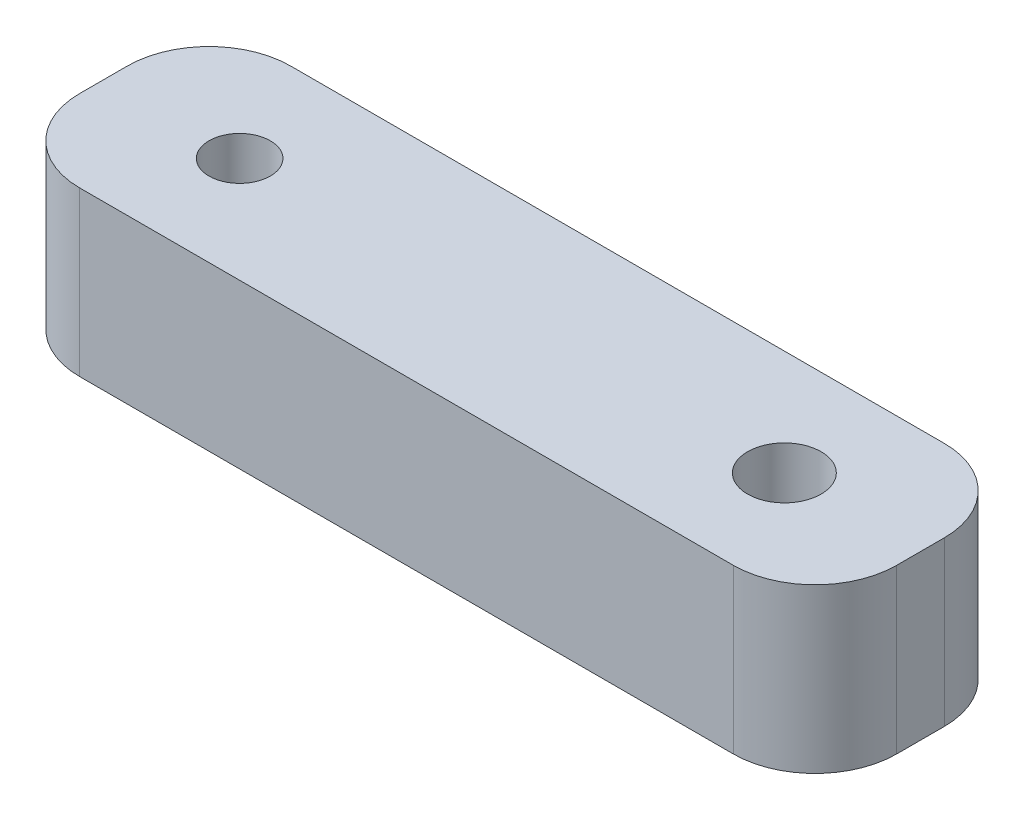
ISO-10303-21;
HEADER;
FILE_DESCRIPTION(('STEP AP214'),'2;1');
FILE_NAME('part.step','',(''),(''),'','','');
FILE_SCHEMA(('AUTOMOTIVE_DESIGN { 1 0 10303 214 1 1 1 1 }'));
ENDSEC;
DATA;
#1=APPLICATION_CONTEXT('core data for automotive mechanical design processes');
#2=APPLICATION_PROTOCOL_DEFINITION('international standard','automotive_design',2000,#1);
#3=PRODUCT_CONTEXT('',#1,'mechanical');
#4=PRODUCT('Part','Part','',(#3));
#5=PRODUCT_RELATED_PRODUCT_CATEGORY('part','',(#4));
#6=PRODUCT_DEFINITION_FORMATION('','',#4);
#7=PRODUCT_DEFINITION_CONTEXT('part definition',#1,'design');
#8=PRODUCT_DEFINITION('design','',#6,#7);
#9=PRODUCT_DEFINITION_SHAPE('','',#8);
#10=(LENGTH_UNIT() NAMED_UNIT(*) SI_UNIT(.MILLI.,.METRE.));
#11=(NAMED_UNIT(*) PLANE_ANGLE_UNIT() SI_UNIT($,.RADIAN.));
#12=(NAMED_UNIT(*) SI_UNIT($,.STERADIAN.) SOLID_ANGLE_UNIT());
#13=UNCERTAINTY_MEASURE_WITH_UNIT(LENGTH_MEASURE(1.E-05),#10,'distance_accuracy_value','');
#14=(GEOMETRIC_REPRESENTATION_CONTEXT(3) GLOBAL_UNCERTAINTY_ASSIGNED_CONTEXT((#13)) GLOBAL_UNIT_ASSIGNED_CONTEXT((#10,
#11,#12)) REPRESENTATION_CONTEXT('',''));
#15=CARTESIAN_POINT('',(0.,0.,0.));
#16=DIRECTION('',(0.,0.,1.));
#17=DIRECTION('',(1.,0.,0.));
#18=AXIS2_PLACEMENT_3D('',#15,#16,#17);
#19=CARTESIAN_POINT('',(-12.,6.,0.875));
#20=DIRECTION('',(0.,-1.,0.));
#21=DIRECTION('',(0.,0.,-1.));
#22=AXIS2_PLACEMENT_3D('',#19,#20,#21);
#23=CYLINDRICAL_SURFACE('',#22,3.);
#24=CARTESIAN_POINT('',(-12.,0.,0.875));
#25=DIRECTION('',(0.,1.,0.));
#26=DIRECTION('',(0.,0.,1.));
#27=AXIS2_PLACEMENT_3D('',#24,#25,#26);
#28=CIRCLE('',#27,3.);
#29=CARTESIAN_POINT('',(-15.,0.,0.875000000000001));
#30=VERTEX_POINT('',#29);
#31=CARTESIAN_POINT('',(-12.,0.,3.875));
#32=VERTEX_POINT('',#31);
#33=EDGE_CURVE('E137',#30,#32,#28,.T.);
#34=ORIENTED_EDGE('',*,*,#33,.T.);
#35=DIRECTION('',(0.,-1.,0.));
#36=VECTOR('',#35,1.);
#37=CARTESIAN_POINT('',(-12.,6.,3.875));
#38=LINE('',#37,#36);
#39=CARTESIAN_POINT('',(-12.,6.,3.875));
#40=VERTEX_POINT('',#39);
#41=EDGE_CURVE('E11',#40,#32,#38,.T.);
#42=ORIENTED_EDGE('',*,*,#41,.F.);
#43=CARTESIAN_POINT('',(-12.,6.,0.875));
#44=DIRECTION('',(0.,1.,0.));
#45=DIRECTION('',(0.,0.,1.));
#46=AXIS2_PLACEMENT_3D('',#43,#44,#45);
#47=CIRCLE('',#46,3.);
#48=CARTESIAN_POINT('',(-15.,6.,0.875000000000001));
#49=VERTEX_POINT('',#48);
#50=EDGE_CURVE('E152',#49,#40,#47,.T.);
#51=ORIENTED_EDGE('',*,*,#50,.F.);
#52=DIRECTION('',(0.,-1.,0.));
#53=VECTOR('',#52,1.);
#54=CARTESIAN_POINT('',(-15.,6.,0.875000000000001));
#55=LINE('',#54,#53);
#56=EDGE_CURVE('E133',#49,#30,#55,.T.);
#57=ORIENTED_EDGE('',*,*,#56,.T.);
#58=EDGE_LOOP('',(#34,#42,#51,#57));
#59=FACE_BOUND('',#58,.T.);
#60=ADVANCED_FACE('F41',(#59),#23,.T.);
#61=CARTESIAN_POINT('',(-12.,6.,3.875));
#62=DIRECTION('',(0.,0.,-1.));
#63=DIRECTION('',(-1.,0.,0.));
#64=AXIS2_PLACEMENT_3D('',#61,#62,#63);
#65=PLANE('',#64);
#66=DIRECTION('',(1.,0.,0.));
#67=VECTOR('',#66,1.);
#68=CARTESIAN_POINT('',(-12.,0.,3.875));
#69=LINE('',#68,#67);
#70=CARTESIAN_POINT('',(12.,0.,3.875));
#71=VERTEX_POINT('',#70);
#72=EDGE_CURVE('E140',#32,#71,#69,.T.);
#73=ORIENTED_EDGE('',*,*,#72,.T.);
#74=DIRECTION('',(0.,-1.,0.));
#75=VECTOR('',#74,1.);
#76=CARTESIAN_POINT('',(12.,6.,3.875));
#77=LINE('',#76,#75);
#78=CARTESIAN_POINT('',(12.,6.,3.875));
#79=VERTEX_POINT('',#78);
#80=EDGE_CURVE('E49',#79,#71,#77,.T.);
#81=ORIENTED_EDGE('',*,*,#80,.F.);
#82=DIRECTION('',(1.,0.,0.));
#83=VECTOR('',#82,1.);
#84=CARTESIAN_POINT('',(-12.,6.,3.875));
#85=LINE('',#84,#83);
#86=EDGE_CURVE('E100',#40,#79,#85,.T.);
#87=ORIENTED_EDGE('',*,*,#86,.F.);
#88=ORIENTED_EDGE('',*,*,#41,.T.);
#89=EDGE_LOOP('',(#73,#81,#87,#88));
#90=FACE_BOUND('',#89,.T.);
#91=ADVANCED_FACE('F221',(#90),#65,.F.);
#92=CARTESIAN_POINT('',(12.,6.,0.875));
#93=DIRECTION('',(0.,-1.,0.));
#94=DIRECTION('',(0.,0.,-1.));
#95=AXIS2_PLACEMENT_3D('',#92,#93,#94);
#96=CYLINDRICAL_SURFACE('',#95,3.);
#97=CARTESIAN_POINT('',(12.,0.,0.875));
#98=DIRECTION('',(0.,1.,0.));
#99=DIRECTION('',(0.,0.,1.));
#100=AXIS2_PLACEMENT_3D('',#97,#98,#99);
#101=CIRCLE('',#100,3.);
#102=CARTESIAN_POINT('',(15.,0.,0.875));
#103=VERTEX_POINT('',#102);
#104=EDGE_CURVE('E143',#71,#103,#101,.T.);
#105=ORIENTED_EDGE('',*,*,#104,.T.);
#106=DIRECTION('',(0.,-1.,0.));
#107=VECTOR('',#106,1.);
#108=CARTESIAN_POINT('',(15.,6.,0.875));
#109=LINE('',#108,#107);
#110=CARTESIAN_POINT('',(15.,6.,0.875));
#111=VERTEX_POINT('',#110);
#112=EDGE_CURVE('E159',#111,#103,#109,.T.);
#113=ORIENTED_EDGE('',*,*,#112,.F.);
#114=CARTESIAN_POINT('',(12.,6.,0.875));
#115=DIRECTION('',(0.,1.,0.));
#116=DIRECTION('',(0.,0.,1.));
#117=AXIS2_PLACEMENT_3D('',#114,#115,#116);
#118=CIRCLE('',#117,3.);
#119=EDGE_CURVE('E167',#79,#111,#118,.T.);
#120=ORIENTED_EDGE('',*,*,#119,.F.);
#121=ORIENTED_EDGE('',*,*,#80,.T.);
#122=EDGE_LOOP('',(#105,#113,#120,#121));
#123=FACE_BOUND('',#122,.T.);
#124=ADVANCED_FACE('F165',(#123),#96,.T.);
#125=CARTESIAN_POINT('',(15.,6.,-0.875));
#126=DIRECTION('',(-1.,0.,0.));
#127=DIRECTION('',(0.,0.,1.));
#128=AXIS2_PLACEMENT_3D('',#125,#126,#127);
#129=PLANE('',#128);
#130=DIRECTION('',(0.,0.,-1.));
#131=VECTOR('',#130,1.);
#132=CARTESIAN_POINT('',(15.,0.,-0.875));
#133=LINE('',#132,#131);
#134=CARTESIAN_POINT('',(15.,0.,-0.875));
#135=VERTEX_POINT('',#134);
#136=EDGE_CURVE('E145',#103,#135,#133,.T.);
#137=ORIENTED_EDGE('',*,*,#136,.T.);
#138=DIRECTION('',(0.,-1.,0.));
#139=VECTOR('',#138,1.);
#140=CARTESIAN_POINT('',(15.,6.,-0.875));
#141=LINE('',#140,#139);
#142=CARTESIAN_POINT('',(15.,6.,-0.875));
#143=VERTEX_POINT('',#142);
#144=EDGE_CURVE('E156',#143,#135,#141,.T.);
#145=ORIENTED_EDGE('',*,*,#144,.F.);
#146=DIRECTION('',(0.,0.,-1.));
#147=VECTOR('',#146,1.);
#148=CARTESIAN_POINT('',(15.,6.,-0.875));
#149=LINE('',#148,#147);
#150=EDGE_CURVE('E179',#111,#143,#149,.T.);
#151=ORIENTED_EDGE('',*,*,#150,.F.);
#152=ORIENTED_EDGE('',*,*,#112,.T.);
#153=EDGE_LOOP('',(#137,#145,#151,#152));
#154=FACE_BOUND('',#153,.T.);
#155=ADVANCED_FACE('F175',(#154),#129,.F.);
#156=CARTESIAN_POINT('',(12.,6.,-0.874999999999999));
#157=DIRECTION('',(0.,-1.,0.));
#158=DIRECTION('',(0.,0.,-1.));
#159=AXIS2_PLACEMENT_3D('',#156,#157,#158);
#160=CYLINDRICAL_SURFACE('',#159,3.);
#161=CARTESIAN_POINT('',(12.,0.,-0.874999999999999));
#162=DIRECTION('',(0.,1.,0.));
#163=DIRECTION('',(0.,0.,-1.));
#164=AXIS2_PLACEMENT_3D('',#161,#162,#163);
#165=CIRCLE('',#164,3.);
#166=CARTESIAN_POINT('',(12.,0.,-3.875));
#167=VERTEX_POINT('',#166);
#168=EDGE_CURVE('E147',#135,#167,#165,.T.);
#169=ORIENTED_EDGE('',*,*,#168,.T.);
#170=DIRECTION('',(0.,-1.,0.));
#171=VECTOR('',#170,1.);
#172=CARTESIAN_POINT('',(12.,6.,-3.875));
#173=LINE('',#172,#171);
#174=CARTESIAN_POINT('',(12.,6.,-3.875));
#175=VERTEX_POINT('',#174);
#176=EDGE_CURVE('E128',#175,#167,#173,.T.);
#177=ORIENTED_EDGE('',*,*,#176,.F.);
#178=CARTESIAN_POINT('',(12.,6.,-0.874999999999999));
#179=DIRECTION('',(0.,1.,0.));
#180=DIRECTION('',(0.,0.,-1.));
#181=AXIS2_PLACEMENT_3D('',#178,#179,#180);
#182=CIRCLE('',#181,3.);
#183=EDGE_CURVE('E119',#143,#175,#182,.T.);
#184=ORIENTED_EDGE('',*,*,#183,.F.);
#185=ORIENTED_EDGE('',*,*,#144,.T.);
#186=EDGE_LOOP('',(#169,#177,#184,#185));
#187=FACE_BOUND('',#186,.T.);
#188=ADVANCED_FACE('F178',(#187),#160,.T.);
#189=CARTESIAN_POINT('',(-12.,6.,-3.875));
#190=DIRECTION('',(0.,0.,1.));
#191=DIRECTION('',(1.,0.,0.));
#192=AXIS2_PLACEMENT_3D('',#189,#190,#191);
#193=PLANE('',#192);
#194=DIRECTION('',(-1.,0.,0.));
#195=VECTOR('',#194,1.);
#196=CARTESIAN_POINT('',(-12.,0.,-3.875));
#197=LINE('',#196,#195);
#198=CARTESIAN_POINT('',(-12.,0.,-3.875));
#199=VERTEX_POINT('',#198);
#200=EDGE_CURVE('E127',#167,#199,#197,.T.);
#201=ORIENTED_EDGE('',*,*,#200,.T.);
#202=DIRECTION('',(0.,-1.,0.));
#203=VECTOR('',#202,1.);
#204=CARTESIAN_POINT('',(-12.,6.,-3.875));
#205=LINE('',#204,#203);
#206=CARTESIAN_POINT('',(-12.,6.,-3.875));
#207=VERTEX_POINT('',#206);
#208=EDGE_CURVE('E124',#207,#199,#205,.T.);
#209=ORIENTED_EDGE('',*,*,#208,.F.);
#210=DIRECTION('',(-1.,0.,0.));
#211=VECTOR('',#210,1.);
#212=CARTESIAN_POINT('',(-12.,6.,-3.875));
#213=LINE('',#212,#211);
#214=EDGE_CURVE('E113',#175,#207,#213,.T.);
#215=ORIENTED_EDGE('',*,*,#214,.F.);
#216=ORIENTED_EDGE('',*,*,#176,.T.);
#217=EDGE_LOOP('',(#201,#209,#215,#216));
#218=FACE_BOUND('',#217,.T.);
#219=ADVANCED_FACE('F125',(#218),#193,.F.);
#220=CARTESIAN_POINT('',(-12.,6.,-0.874999999999999));
#221=DIRECTION('',(0.,-1.,0.));
#222=DIRECTION('',(0.,0.,-1.));
#223=AXIS2_PLACEMENT_3D('',#220,#221,#222);
#224=CYLINDRICAL_SURFACE('',#223,3.);
#225=CARTESIAN_POINT('',(-12.,0.,-0.874999999999999));
#226=DIRECTION('',(0.,1.,0.));
#227=DIRECTION('',(0.,0.,1.));
#228=AXIS2_PLACEMENT_3D('',#225,#226,#227);
#229=CIRCLE('',#228,3.);
#230=CARTESIAN_POINT('',(-15.,0.,-0.874999999999999));
#231=VERTEX_POINT('',#230);
#232=EDGE_CURVE('E86',#199,#231,#229,.T.);
#233=ORIENTED_EDGE('',*,*,#232,.T.);
#234=DIRECTION('',(0.,-1.,0.));
#235=VECTOR('',#234,1.);
#236=CARTESIAN_POINT('',(-15.,6.,-0.874999999999999));
#237=LINE('',#236,#235);
#238=CARTESIAN_POINT('',(-15.,6.,-0.874999999999999));
#239=VERTEX_POINT('',#238);
#240=EDGE_CURVE('E129',#239,#231,#237,.T.);
#241=ORIENTED_EDGE('',*,*,#240,.F.);
#242=CARTESIAN_POINT('',(-12.,6.,-0.874999999999999));
#243=DIRECTION('',(0.,1.,0.));
#244=DIRECTION('',(0.,0.,1.));
#245=AXIS2_PLACEMENT_3D('',#242,#243,#244);
#246=CIRCLE('',#245,3.);
#247=EDGE_CURVE('E117',#207,#239,#246,.T.);
#248=ORIENTED_EDGE('',*,*,#247,.F.);
#249=ORIENTED_EDGE('',*,*,#208,.T.);
#250=EDGE_LOOP('',(#233,#241,#248,#249));
#251=FACE_BOUND('',#250,.T.);
#252=ADVANCED_FACE('F131',(#251),#224,.T.);
#253=CARTESIAN_POINT('',(-15.,6.,-0.874999999999999));
#254=DIRECTION('',(1.,0.,0.));
#255=DIRECTION('',(0.,0.,-1.));
#256=AXIS2_PLACEMENT_3D('',#253,#254,#255);
#257=PLANE('',#256);
#258=DIRECTION('',(0.,0.,1.));
#259=VECTOR('',#258,1.);
#260=CARTESIAN_POINT('',(-15.,0.,-0.874999999999999));
#261=LINE('',#260,#259);
#262=EDGE_CURVE('E92',#231,#30,#261,.T.);
#263=ORIENTED_EDGE('',*,*,#262,.T.);
#264=ORIENTED_EDGE('',*,*,#56,.F.);
#265=DIRECTION('',(0.,0.,1.));
#266=VECTOR('',#265,1.);
#267=CARTESIAN_POINT('',(-15.,6.,-0.874999999999999));
#268=LINE('',#267,#266);
#269=EDGE_CURVE('E57',#239,#49,#268,.T.);
#270=ORIENTED_EDGE('',*,*,#269,.F.);
#271=ORIENTED_EDGE('',*,*,#240,.T.);
#272=EDGE_LOOP('',(#263,#264,#270,#271));
#273=FACE_BOUND('',#272,.T.);
#274=ADVANCED_FACE('F208',(#273),#257,.F.);
#275=CARTESIAN_POINT('',(-12.,6.,0.875));
#276=DIRECTION('',(0.,1.,0.));
#277=DIRECTION('',(0.,0.,1.));
#278=AXIS2_PLACEMENT_3D('',#275,#276,#277);
#279=PLANE('',#278);
#280=CARTESIAN_POINT('',(-10.,6.,0.));
#281=DIRECTION('',(0.,1.,0.));
#282=DIRECTION('',(0.,0.,1.));
#283=AXIS2_PLACEMENT_3D('',#280,#281,#282);
#284=CIRCLE('',#283,1.125);
#285=CARTESIAN_POINT('',(-10.,6.,1.125));
#286=VERTEX_POINT('',#285);
#287=EDGE_CURVE('E191',#286,#286,#284,.T.);
#288=ORIENTED_EDGE('',*,*,#287,.F.);
#289=EDGE_LOOP('',(#288));
#290=FACE_BOUND('',#289,.T.);
#291=CARTESIAN_POINT('',(10.,6.,0.));
#292=DIRECTION('',(0.,1.,0.));
#293=DIRECTION('',(0.,0.,1.));
#294=AXIS2_PLACEMENT_3D('',#291,#292,#293);
#295=CIRCLE('',#294,1.35);
#296=CARTESIAN_POINT('',(10.,6.,1.35));
#297=VERTEX_POINT('',#296);
#298=EDGE_CURVE('E188',#297,#297,#295,.T.);
#299=ORIENTED_EDGE('',*,*,#298,.F.);
#300=EDGE_LOOP('',(#299));
#301=FACE_BOUND('',#300,.T.);
#302=ORIENTED_EDGE('',*,*,#50,.T.);
#303=ORIENTED_EDGE('',*,*,#86,.T.);
#304=ORIENTED_EDGE('',*,*,#119,.T.);
#305=ORIENTED_EDGE('',*,*,#150,.T.);
#306=ORIENTED_EDGE('',*,*,#183,.T.);
#307=ORIENTED_EDGE('',*,*,#214,.T.);
#308=ORIENTED_EDGE('',*,*,#247,.T.);
#309=ORIENTED_EDGE('',*,*,#269,.T.);
#310=EDGE_LOOP('',(#302,#303,#304,#305,#306,#307,#308,#309));
#311=FACE_BOUND('',#310,.T.);
#312=ADVANCED_FACE('F115',(#290,#301,#311),#279,.T.);
#313=CARTESIAN_POINT('',(-12.,0.,0.875));
#314=DIRECTION('',(0.,1.,0.));
#315=DIRECTION('',(0.,0.,1.));
#316=AXIS2_PLACEMENT_3D('',#313,#314,#315);
#317=PLANE('',#316);
#318=CARTESIAN_POINT('',(-10.,0.,0.));
#319=DIRECTION('',(0.,1.,0.));
#320=DIRECTION('',(0.,0.,1.));
#321=AXIS2_PLACEMENT_3D('',#318,#319,#320);
#322=CIRCLE('',#321,1.125);
#323=CARTESIAN_POINT('',(-10.,0.,1.125));
#324=VERTEX_POINT('',#323);
#325=EDGE_CURVE('E141',#324,#324,#322,.T.);
#326=ORIENTED_EDGE('',*,*,#325,.T.);
#327=EDGE_LOOP('',(#326));
#328=FACE_BOUND('',#327,.T.);
#329=CARTESIAN_POINT('',(10.,0.,0.));
#330=DIRECTION('',(0.,1.,0.));
#331=DIRECTION('',(0.,0.,1.));
#332=AXIS2_PLACEMENT_3D('',#329,#330,#331);
#333=CIRCLE('',#332,1.35);
#334=CARTESIAN_POINT('',(10.,0.,1.35));
#335=VERTEX_POINT('',#334);
#336=EDGE_CURVE('E185',#335,#335,#333,.T.);
#337=ORIENTED_EDGE('',*,*,#336,.T.);
#338=EDGE_LOOP('',(#337));
#339=FACE_BOUND('',#338,.T.);
#340=ORIENTED_EDGE('',*,*,#33,.F.);
#341=ORIENTED_EDGE('',*,*,#262,.F.);
#342=ORIENTED_EDGE('',*,*,#232,.F.);
#343=ORIENTED_EDGE('',*,*,#200,.F.);
#344=ORIENTED_EDGE('',*,*,#168,.F.);
#345=ORIENTED_EDGE('',*,*,#136,.F.);
#346=ORIENTED_EDGE('',*,*,#104,.F.);
#347=ORIENTED_EDGE('',*,*,#72,.F.);
#348=EDGE_LOOP('',(#340,#341,#342,#343,#344,#345,#346,#347));
#349=FACE_BOUND('',#348,.T.);
#350=ADVANCED_FACE('F171',(#328,#339,#349),#317,.F.);
#351=CARTESIAN_POINT('',(10.,0.,0.));
#352=DIRECTION('',(0.,1.,0.));
#353=DIRECTION('',(0.,0.,1.));
#354=AXIS2_PLACEMENT_3D('',#351,#352,#353);
#355=CYLINDRICAL_SURFACE('',#354,1.35);
#356=ORIENTED_EDGE('',*,*,#336,.F.);
#357=EDGE_LOOP('',(#356));
#358=FACE_BOUND('',#357,.T.);
#359=ORIENTED_EDGE('',*,*,#298,.T.);
#360=EDGE_LOOP('',(#359));
#361=FACE_BOUND('',#360,.T.);
#362=ADVANCED_FACE('F202',(#358,#361),#355,.F.);
#363=CARTESIAN_POINT('',(-10.,0.,0.));
#364=DIRECTION('',(0.,1.,0.));
#365=DIRECTION('',(0.,0.,1.));
#366=AXIS2_PLACEMENT_3D('',#363,#364,#365);
#367=CYLINDRICAL_SURFACE('',#366,1.125);
#368=ORIENTED_EDGE('',*,*,#325,.F.);
#369=EDGE_LOOP('',(#368));
#370=FACE_BOUND('',#369,.T.);
#371=ORIENTED_EDGE('',*,*,#287,.T.);
#372=EDGE_LOOP('',(#371));
#373=FACE_BOUND('',#372,.T.);
#374=ADVANCED_FACE('F199',(#370,#373),#367,.F.);
#375=CLOSED_SHELL('',(#60,#91,#124,#155,#188,#219,#252,#274,#312,#350,#362,#374));
#376=MANIFOLD_SOLID_BREP('B2',#375);
#377=ADVANCED_BREP_SHAPE_REPRESENTATION('',(#18,#376),#14);
#378=SHAPE_DEFINITION_REPRESENTATION(#9,#377);
ENDSEC;
END-ISO-10303-21;
